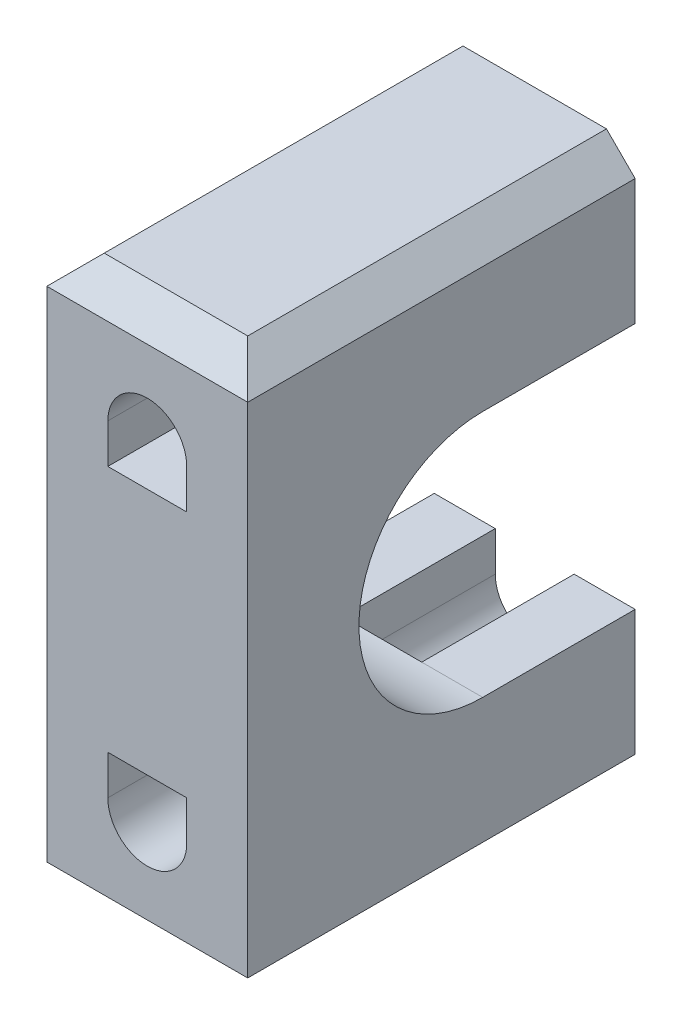
ISO-10303-21;
HEADER;
FILE_DESCRIPTION(('STEP AP214'),'2;1');
FILE_NAME('part.step','',(''),(''),'','','');
FILE_SCHEMA(('AUTOMOTIVE_DESIGN { 1 0 10303 214 1 1 1 1 }'));
ENDSEC;
DATA;
#1=APPLICATION_CONTEXT('core data for automotive mechanical design processes');
#2=APPLICATION_PROTOCOL_DEFINITION('international standard','automotive_design',2000,#1);
#3=PRODUCT_CONTEXT('',#1,'mechanical');
#4=PRODUCT('Part','Part','',(#3));
#5=PRODUCT_RELATED_PRODUCT_CATEGORY('part','',(#4));
#6=PRODUCT_DEFINITION_FORMATION('','',#4);
#7=PRODUCT_DEFINITION_CONTEXT('part definition',#1,'design');
#8=PRODUCT_DEFINITION('design','',#6,#7);
#9=PRODUCT_DEFINITION_SHAPE('','',#8);
#10=(LENGTH_UNIT() NAMED_UNIT(*) SI_UNIT(.MILLI.,.METRE.));
#11=(NAMED_UNIT(*) PLANE_ANGLE_UNIT() SI_UNIT($,.RADIAN.));
#12=(NAMED_UNIT(*) SI_UNIT($,.STERADIAN.) SOLID_ANGLE_UNIT());
#13=UNCERTAINTY_MEASURE_WITH_UNIT(LENGTH_MEASURE(1.E-05),#10,'distance_accuracy_value','');
#14=(GEOMETRIC_REPRESENTATION_CONTEXT(3) GLOBAL_UNCERTAINTY_ASSIGNED_CONTEXT((#13)) GLOBAL_UNIT_ASSIGNED_CONTEXT((#10,
#11,#12)) REPRESENTATION_CONTEXT('',''));
#15=CARTESIAN_POINT('',(0.,0.,0.));
#16=DIRECTION('',(0.,0.,1.));
#17=DIRECTION('',(1.,0.,0.));
#18=AXIS2_PLACEMENT_3D('',#15,#16,#17);
#19=CARTESIAN_POINT('',(0.,0.,0.));
#20=DIRECTION('',(0.,0.,1.));
#21=DIRECTION('',(1.,0.,0.));
#22=AXIS2_PLACEMENT_3D('',#19,#20,#21);
#23=PLANE('',#22);
#24=DIRECTION('',(1.,0.,0.));
#25=VECTOR('',#24,1.);
#26=CARTESIAN_POINT('',(0.,-19.375,0.));
#27=LINE('',#26,#25);
#28=CARTESIAN_POINT('',(-5.,-19.375,0.));
#29=VERTEX_POINT('',#28);
#30=CARTESIAN_POINT('',(4.99999999999999,-19.375,0.));
#31=VERTEX_POINT('',#30);
#32=EDGE_CURVE('E255',#29,#31,#27,.T.);
#33=ORIENTED_EDGE('',*,*,#32,.F.);
#34=DIRECTION('',(0.707106781186546,-0.707106781186549,0.));
#35=VECTOR('',#34,1.);
#36=CARTESIAN_POINT('',(-5.,-19.375,0.));
#37=LINE('',#36,#35);
#38=CARTESIAN_POINT('',(-7.,-17.375,0.));
#39=VERTEX_POINT('',#38);
#40=EDGE_CURVE('E340',#29,#39,#37,.F.);
#41=ORIENTED_EDGE('',*,*,#40,.T.);
#42=DIRECTION('',(0.,-1.,0.));
#43=VECTOR('',#42,1.);
#44=CARTESIAN_POINT('',(-7.,0.,0.));
#45=LINE('',#44,#43);
#46=CARTESIAN_POINT('',(-7.,-8.625,0.));
#47=VERTEX_POINT('',#46);
#48=EDGE_CURVE('E303',#47,#39,#45,.T.);
#49=ORIENTED_EDGE('',*,*,#48,.F.);
#50=DIRECTION('',(1.,0.,0.));
#51=VECTOR('',#50,1.);
#52=CARTESIAN_POINT('',(0.,-8.625,0.));
#53=LINE('',#52,#51);
#54=CARTESIAN_POINT('',(-2.75,-8.625,0.));
#55=VERTEX_POINT('',#54);
#56=EDGE_CURVE('E330',#47,#55,#53,.T.);
#57=ORIENTED_EDGE('',*,*,#56,.T.);
#58=DIRECTION('',(0.,1.,0.));
#59=VECTOR('',#58,1.);
#60=CARTESIAN_POINT('',(-2.75,0.,0.));
#61=LINE('',#60,#59);
#62=CARTESIAN_POINT('',(-2.75,-11.375,0.));
#63=VERTEX_POINT('',#62);
#64=EDGE_CURVE('E251',#63,#55,#61,.T.);
#65=ORIENTED_EDGE('',*,*,#64,.F.);
#66=CARTESIAN_POINT('',(0.,-11.375,0.));
#67=DIRECTION('',(0.,0.,1.));
#68=DIRECTION('',(1.,0.,0.));
#69=AXIS2_PLACEMENT_3D('',#66,#67,#68);
#70=CIRCLE('',#69,2.75);
#71=CARTESIAN_POINT('',(2.75,-11.375,0.));
#72=VERTEX_POINT('',#71);
#73=EDGE_CURVE('E286',#63,#72,#70,.T.);
#74=ORIENTED_EDGE('',*,*,#73,.T.);
#75=DIRECTION('',(0.,1.,0.));
#76=VECTOR('',#75,1.);
#77=CARTESIAN_POINT('',(2.75,0.,0.));
#78=LINE('',#77,#76);
#79=CARTESIAN_POINT('',(2.75,-8.625,0.));
#80=VERTEX_POINT('',#79);
#81=EDGE_CURVE('E283',#72,#80,#78,.T.);
#82=ORIENTED_EDGE('',*,*,#81,.T.);
#83=DIRECTION('',(-1.,0.,0.));
#84=VECTOR('',#83,1.);
#85=CARTESIAN_POINT('',(7.00000000000001,-8.625,0.));
#86=LINE('',#85,#84);
#87=CARTESIAN_POINT('',(7.00000000000001,-8.625,0.));
#88=VERTEX_POINT('',#87);
#89=EDGE_CURVE('E235',#88,#80,#86,.T.);
#90=ORIENTED_EDGE('',*,*,#89,.F.);
#91=DIRECTION('',(0.,-1.,0.));
#92=VECTOR('',#91,1.);
#93=CARTESIAN_POINT('',(7.,0.,0.));
#94=LINE('',#93,#92);
#95=CARTESIAN_POINT('',(7.00000000000001,-17.375,0.));
#96=VERTEX_POINT('',#95);
#97=EDGE_CURVE('E223',#88,#96,#94,.T.);
#98=ORIENTED_EDGE('',*,*,#97,.T.);
#99=DIRECTION('',(-0.707106781186549,-0.707106781186546,0.));
#100=VECTOR('',#99,1.);
#101=CARTESIAN_POINT('',(7.00000000000001,-17.375,0.));
#102=LINE('',#101,#100);
#103=EDGE_CURVE('E338',#96,#31,#102,.T.);
#104=ORIENTED_EDGE('',*,*,#103,.T.);
#105=EDGE_LOOP('',(#33,#41,#49,#57,#65,#74,#82,#90,#98,#104));
#106=FACE_BOUND('',#105,.T.);
#107=ADVANCED_FACE('F43',(#106),#23,.F.);
#108=CARTESIAN_POINT('',(7.,0.,27.));
#109=DIRECTION('',(1.,0.,0.));
#110=DIRECTION('',(0.,1.,0.));
#111=AXIS2_PLACEMENT_3D('',#108,#109,#110);
#112=PLANE('',#111);
#113=DIRECTION('',(0.,-1.,0.));
#114=VECTOR('',#113,1.);
#115=CARTESIAN_POINT('',(7.,0.,27.));
#116=LINE('',#115,#114);
#117=CARTESIAN_POINT('',(7.,17.375,27.));
#118=VERTEX_POINT('',#117);
#119=CARTESIAN_POINT('',(7.00000000000001,-17.375,27.));
#120=VERTEX_POINT('',#119);
#121=EDGE_CURVE('E275',#118,#120,#116,.T.);
#122=ORIENTED_EDGE('',*,*,#121,.T.);
#123=DIRECTION('',(0.,0.,-1.));
#124=VECTOR('',#123,1.);
#125=CARTESIAN_POINT('',(7.00000000000001,-17.375,0.));
#126=LINE('',#125,#124);
#127=EDGE_CURVE('E351',#120,#96,#126,.T.);
#128=ORIENTED_EDGE('',*,*,#127,.T.);
#129=ORIENTED_EDGE('',*,*,#97,.F.);
#130=DIRECTION('',(0.,0.,1.));
#131=VECTOR('',#130,1.);
#132=CARTESIAN_POINT('',(7.00000000000001,-8.625,0.));
#133=LINE('',#132,#131);
#134=CARTESIAN_POINT('',(7.00000000000001,-8.625,10.625));
#135=VERTEX_POINT('',#134);
#136=EDGE_CURVE('E196',#88,#135,#133,.T.);
#137=ORIENTED_EDGE('',*,*,#136,.T.);
#138=CARTESIAN_POINT('',(7.00000000000001,0.,10.625));
#139=DIRECTION('',(-1.,0.,0.));
#140=DIRECTION('',(0.,-1.,0.));
#141=AXIS2_PLACEMENT_3D('',#138,#139,#140);
#142=CIRCLE('',#141,8.625);
#143=CARTESIAN_POINT('',(7.00000000000001,8.625,10.625));
#144=VERTEX_POINT('',#143);
#145=EDGE_CURVE('E208',#135,#144,#142,.T.);
#146=ORIENTED_EDGE('',*,*,#145,.T.);
#147=DIRECTION('',(0.,0.,-1.));
#148=VECTOR('',#147,1.);
#149=CARTESIAN_POINT('',(7.00000000000001,8.625,0.));
#150=LINE('',#149,#148);
#151=CARTESIAN_POINT('',(7.00000000000001,8.625,0.));
#152=VERTEX_POINT('',#151);
#153=EDGE_CURVE('E216',#144,#152,#150,.T.);
#154=ORIENTED_EDGE('',*,*,#153,.T.);
#155=CARTESIAN_POINT('',(7.,17.375,0.));
#156=VERTEX_POINT('',#155);
#157=EDGE_CURVE('E298',#156,#152,#94,.T.);
#158=ORIENTED_EDGE('',*,*,#157,.F.);
#159=DIRECTION('',(0.,0.,1.));
#160=VECTOR('',#159,1.);
#161=CARTESIAN_POINT('',(7.,17.375,27.));
#162=LINE('',#161,#160);
#163=EDGE_CURVE('E348',#156,#118,#162,.T.);
#164=ORIENTED_EDGE('',*,*,#163,.T.);
#165=EDGE_LOOP('',(#122,#128,#129,#137,#146,#154,#158,#164));
#166=FACE_BOUND('',#165,.T.);
#167=ADVANCED_FACE('F220',(#166),#112,.T.);
#168=CARTESIAN_POINT('',(0.,19.375,27.));
#169=DIRECTION('',(0.,1.,0.));
#170=DIRECTION('',(0.,0.,1.));
#171=AXIS2_PLACEMENT_3D('',#168,#169,#170);
#172=PLANE('',#171);
#173=DIRECTION('',(0.,0.,1.));
#174=VECTOR('',#173,1.);
#175=CARTESIAN_POINT('',(-4.99999999999999,19.375,27.));
#176=LINE('',#175,#174);
#177=CARTESIAN_POINT('',(-4.99999999999999,19.375,0.));
#178=VERTEX_POINT('',#177);
#179=CARTESIAN_POINT('',(-4.99999999999999,19.375,25.));
#180=VERTEX_POINT('',#179);
#181=EDGE_CURVE('E359',#178,#180,#176,.T.);
#182=ORIENTED_EDGE('',*,*,#181,.T.);
#183=DIRECTION('',(1.,0.,0.));
#184=VECTOR('',#183,1.);
#185=CARTESIAN_POINT('',(0.,19.375,25.));
#186=LINE('',#185,#184);
#187=CARTESIAN_POINT('',(4.99999999999998,19.375,25.));
#188=VERTEX_POINT('',#187);
#189=EDGE_CURVE('E372',#180,#188,#186,.T.);
#190=ORIENTED_EDGE('',*,*,#189,.T.);
#191=DIRECTION('',(0.,0.,-1.));
#192=VECTOR('',#191,1.);
#193=CARTESIAN_POINT('',(4.99999999999998,19.375,27.));
#194=LINE('',#193,#192);
#195=CARTESIAN_POINT('',(4.99999999999998,19.375,0.));
#196=VERTEX_POINT('',#195);
#197=EDGE_CURVE('E357',#188,#196,#194,.T.);
#198=ORIENTED_EDGE('',*,*,#197,.T.);
#199=DIRECTION('',(1.,0.,0.));
#200=VECTOR('',#199,1.);
#201=CARTESIAN_POINT('',(0.,19.375,0.));
#202=LINE('',#201,#200);
#203=EDGE_CURVE('E300',#178,#196,#202,.T.);
#204=ORIENTED_EDGE('',*,*,#203,.F.);
#205=EDGE_LOOP('',(#182,#190,#198,#204));
#206=FACE_BOUND('',#205,.T.);
#207=ADVANCED_FACE('F386',(#206),#172,.T.);
#208=CARTESIAN_POINT('',(-7.,0.,27.));
#209=DIRECTION('',(1.,0.,0.));
#210=DIRECTION('',(0.,0.,-1.));
#211=AXIS2_PLACEMENT_3D('',#208,#209,#210);
#212=PLANE('',#211);
#213=ORIENTED_EDGE('',*,*,#48,.T.);
#214=DIRECTION('',(0.,0.,1.));
#215=VECTOR('',#214,1.);
#216=CARTESIAN_POINT('',(-7.,-17.375,27.));
#217=LINE('',#216,#215);
#218=CARTESIAN_POINT('',(-7.,-17.375,27.));
#219=VERTEX_POINT('',#218);
#220=EDGE_CURVE('E345',#39,#219,#217,.T.);
#221=ORIENTED_EDGE('',*,*,#220,.T.);
#222=DIRECTION('',(0.,-1.,0.));
#223=VECTOR('',#222,1.);
#224=CARTESIAN_POINT('',(-7.,0.,27.));
#225=LINE('',#224,#223);
#226=CARTESIAN_POINT('',(-7.,17.375,27.));
#227=VERTEX_POINT('',#226);
#228=EDGE_CURVE('E277',#227,#219,#225,.T.);
#229=ORIENTED_EDGE('',*,*,#228,.F.);
#230=DIRECTION('',(0.,0.,-1.));
#231=VECTOR('',#230,1.);
#232=CARTESIAN_POINT('',(-7.,17.375,0.));
#233=LINE('',#232,#231);
#234=CARTESIAN_POINT('',(-7.,17.375,0.));
#235=VERTEX_POINT('',#234);
#236=EDGE_CURVE('E342',#227,#235,#233,.T.);
#237=ORIENTED_EDGE('',*,*,#236,.T.);
#238=CARTESIAN_POINT('',(-7.,8.625,0.));
#239=VERTEX_POINT('',#238);
#240=EDGE_CURVE('E304',#235,#239,#45,.T.);
#241=ORIENTED_EDGE('',*,*,#240,.T.);
#242=DIRECTION('',(0.,0.,-1.));
#243=VECTOR('',#242,1.);
#244=CARTESIAN_POINT('',(-7.,8.625,0.));
#245=LINE('',#244,#243);
#246=CARTESIAN_POINT('',(-7.,8.625,10.625));
#247=VERTEX_POINT('',#246);
#248=EDGE_CURVE('E224',#247,#239,#245,.T.);
#249=ORIENTED_EDGE('',*,*,#248,.F.);
#250=CARTESIAN_POINT('',(-7.,0.,10.625));
#251=DIRECTION('',(-1.,0.,0.));
#252=DIRECTION('',(0.,-1.,0.));
#253=AXIS2_PLACEMENT_3D('',#250,#251,#252);
#254=CIRCLE('',#253,8.625);
#255=CARTESIAN_POINT('',(-7.,-8.625,10.625));
#256=VERTEX_POINT('',#255);
#257=EDGE_CURVE('E227',#256,#247,#254,.T.);
#258=ORIENTED_EDGE('',*,*,#257,.F.);
#259=DIRECTION('',(0.,0.,1.));
#260=VECTOR('',#259,1.);
#261=CARTESIAN_POINT('',(-7.,-8.625,0.));
#262=LINE('',#261,#260);
#263=EDGE_CURVE('E231',#47,#256,#262,.T.);
#264=ORIENTED_EDGE('',*,*,#263,.F.);
#265=EDGE_LOOP('',(#213,#221,#229,#237,#241,#249,#258,#264));
#266=FACE_BOUND('',#265,.T.);
#267=ADVANCED_FACE('F393',(#266),#212,.F.);
#268=CARTESIAN_POINT('',(0.,11.375,27.));
#269=DIRECTION('',(0.,0.,-1.));
#270=DIRECTION('',(-1.,0.,0.));
#271=AXIS2_PLACEMENT_3D('',#268,#269,#270);
#272=CYLINDRICAL_SURFACE('',#271,2.75);
#273=CARTESIAN_POINT('',(0.,11.375,0.));
#274=DIRECTION('',(0.,0.,1.));
#275=DIRECTION('',(1.,0.,0.));
#276=AXIS2_PLACEMENT_3D('',#273,#274,#275);
#277=CIRCLE('',#276,2.75);
#278=CARTESIAN_POINT('',(2.75,11.375,0.));
#279=VERTEX_POINT('',#278);
#280=CARTESIAN_POINT('',(-2.75,11.375,0.));
#281=VERTEX_POINT('',#280);
#282=EDGE_CURVE('E289',#279,#281,#277,.T.);
#283=ORIENTED_EDGE('',*,*,#282,.F.);
#284=DIRECTION('',(0.,0.,-1.));
#285=VECTOR('',#284,1.);
#286=CARTESIAN_POINT('',(2.75,11.375,27.));
#287=LINE('',#286,#285);
#288=CARTESIAN_POINT('',(2.75,11.375,27.));
#289=VERTEX_POINT('',#288);
#290=EDGE_CURVE('E317',#289,#279,#287,.T.);
#291=ORIENTED_EDGE('',*,*,#290,.F.);
#292=CARTESIAN_POINT('',(0.,11.375,27.));
#293=DIRECTION('',(0.,0.,1.));
#294=DIRECTION('',(1.,0.,0.));
#295=AXIS2_PLACEMENT_3D('',#292,#293,#294);
#296=CIRCLE('',#295,2.75);
#297=CARTESIAN_POINT('',(-2.75,11.375,27.));
#298=VERTEX_POINT('',#297);
#299=EDGE_CURVE('E264',#289,#298,#296,.T.);
#300=ORIENTED_EDGE('',*,*,#299,.T.);
#301=DIRECTION('',(0.,0.,-1.));
#302=VECTOR('',#301,1.);
#303=CARTESIAN_POINT('',(-2.75,11.375,27.));
#304=LINE('',#303,#302);
#305=EDGE_CURVE('E308',#298,#281,#304,.T.);
#306=ORIENTED_EDGE('',*,*,#305,.T.);
#307=EDGE_LOOP('',(#283,#291,#300,#306));
#308=FACE_BOUND('',#307,.T.);
#309=ADVANCED_FACE('F632',(#308),#272,.F.);
#310=CARTESIAN_POINT('',(2.75,0.,27.));
#311=DIRECTION('',(1.,0.,0.));
#312=DIRECTION('',(0.,0.,-1.));
#313=AXIS2_PLACEMENT_3D('',#310,#311,#312);
#314=PLANE('',#313);
#315=DIRECTION('',(0.,-1.,0.));
#316=VECTOR('',#315,1.);
#317=CARTESIAN_POINT('',(2.75,0.,0.));
#318=LINE('',#317,#316);
#319=CARTESIAN_POINT('',(2.75,8.625,0.));
#320=VERTEX_POINT('',#319);
#321=EDGE_CURVE('E292',#279,#320,#318,.T.);
#322=ORIENTED_EDGE('',*,*,#321,.T.);
#323=DIRECTION('',(0.,0.,1.));
#324=VECTOR('',#323,1.);
#325=CARTESIAN_POINT('',(2.75,8.62500000000001,27.));
#326=LINE('',#325,#324);
#327=CARTESIAN_POINT('',(2.75,8.625,10.625));
#328=VERTEX_POINT('',#327);
#329=EDGE_CURVE('E244',#320,#328,#326,.T.);
#330=ORIENTED_EDGE('',*,*,#329,.T.);
#331=DIRECTION('',(0.,0.,-1.));
#332=VECTOR('',#331,1.);
#333=CARTESIAN_POINT('',(2.75,8.625,27.));
#334=LINE('',#333,#332);
#335=CARTESIAN_POINT('',(2.75,8.625,27.));
#336=VERTEX_POINT('',#335);
#337=EDGE_CURVE('E314',#336,#328,#334,.T.);
#338=ORIENTED_EDGE('',*,*,#337,.F.);
#339=DIRECTION('',(0.,-1.,0.));
#340=VECTOR('',#339,1.);
#341=CARTESIAN_POINT('',(2.75,0.,27.));
#342=LINE('',#341,#340);
#343=EDGE_CURVE('E267',#289,#336,#342,.T.);
#344=ORIENTED_EDGE('',*,*,#343,.F.);
#345=ORIENTED_EDGE('',*,*,#290,.T.);
#346=EDGE_LOOP('',(#322,#330,#338,#344,#345));
#347=FACE_BOUND('',#346,.T.);
#348=ADVANCED_FACE('F624',(#347),#314,.F.);
#349=CARTESIAN_POINT('',(0.,8.625,27.));
#350=DIRECTION('',(0.,-1.,0.));
#351=DIRECTION('',(0.,0.,-1.));
#352=AXIS2_PLACEMENT_3D('',#349,#350,#351);
#353=PLANE('',#352);
#354=ORIENTED_EDGE('',*,*,#337,.T.);
#355=DIRECTION('',(-1.,0.,0.));
#356=VECTOR('',#355,1.);
#357=CARTESIAN_POINT('',(7.00000000000001,8.625,10.625));
#358=LINE('',#357,#356);
#359=CARTESIAN_POINT('',(-2.75,8.625,10.625));
#360=VERTEX_POINT('',#359);
#361=EDGE_CURVE('E241',#328,#360,#358,.T.);
#362=ORIENTED_EDGE('',*,*,#361,.T.);
#363=DIRECTION('',(0.,0.,-1.));
#364=VECTOR('',#363,1.);
#365=CARTESIAN_POINT('',(-2.75,8.625,27.));
#366=LINE('',#365,#364);
#367=CARTESIAN_POINT('',(-2.75,8.625,27.));
#368=VERTEX_POINT('',#367);
#369=EDGE_CURVE('E310',#368,#360,#366,.T.);
#370=ORIENTED_EDGE('',*,*,#369,.F.);
#371=DIRECTION('',(-1.,0.,0.));
#372=VECTOR('',#371,1.);
#373=CARTESIAN_POINT('',(0.,8.625,27.));
#374=LINE('',#373,#372);
#375=EDGE_CURVE('E270',#336,#368,#374,.T.);
#376=ORIENTED_EDGE('',*,*,#375,.F.);
#377=EDGE_LOOP('',(#354,#362,#370,#376));
#378=FACE_BOUND('',#377,.T.);
#379=ADVANCED_FACE('F407',(#378),#353,.F.);
#380=CARTESIAN_POINT('',(-2.75,0.,27.));
#381=DIRECTION('',(-1.,0.,0.));
#382=DIRECTION('',(0.,0.,1.));
#383=AXIS2_PLACEMENT_3D('',#380,#381,#382);
#384=PLANE('',#383);
#385=ORIENTED_EDGE('',*,*,#64,.T.);
#386=DIRECTION('',(0.,0.,1.));
#387=VECTOR('',#386,1.);
#388=CARTESIAN_POINT('',(-2.75,-8.62500000000001,27.));
#389=LINE('',#388,#387);
#390=CARTESIAN_POINT('',(-2.74999999999999,-8.625,10.625));
#391=VERTEX_POINT('',#390);
#392=EDGE_CURVE('E248',#55,#391,#389,.T.);
#393=ORIENTED_EDGE('',*,*,#392,.T.);
#394=DIRECTION('',(0.,0.,-1.));
#395=VECTOR('',#394,1.);
#396=CARTESIAN_POINT('',(-2.75,-8.625,27.));
#397=LINE('',#396,#395);
#398=CARTESIAN_POINT('',(-2.75,-8.625,27.));
#399=VERTEX_POINT('',#398);
#400=EDGE_CURVE('E311',#399,#391,#397,.T.);
#401=ORIENTED_EDGE('',*,*,#400,.F.);
#402=DIRECTION('',(0.,1.,0.));
#403=VECTOR('',#402,1.);
#404=CARTESIAN_POINT('',(-2.75,0.,27.));
#405=LINE('',#404,#403);
#406=CARTESIAN_POINT('',(-2.75,-11.375,27.));
#407=VERTEX_POINT('',#406);
#408=EDGE_CURVE('E252',#407,#399,#405,.T.);
#409=ORIENTED_EDGE('',*,*,#408,.F.);
#410=DIRECTION('',(0.,0.,-1.));
#411=VECTOR('',#410,1.);
#412=CARTESIAN_POINT('',(-2.75,-11.375,27.));
#413=LINE('',#412,#411);
#414=EDGE_CURVE('E280',#407,#63,#413,.T.);
#415=ORIENTED_EDGE('',*,*,#414,.T.);
#416=EDGE_LOOP('',(#385,#393,#401,#409,#415));
#417=FACE_BOUND('',#416,.T.);
#418=ADVANCED_FACE('F483',(#417),#384,.F.);
#419=CARTESIAN_POINT('',(0.,-8.625,27.));
#420=DIRECTION('',(0.,-1.,0.));
#421=DIRECTION('',(0.,0.,-1.));
#422=AXIS2_PLACEMENT_3D('',#419,#420,#421);
#423=PLANE('',#422);
#424=DIRECTION('',(-1.,0.,0.));
#425=VECTOR('',#424,1.);
#426=CARTESIAN_POINT('',(7.00000000000001,-8.625,10.625));
#427=LINE('',#426,#425);
#428=CARTESIAN_POINT('',(2.75,-8.625,10.625));
#429=VERTEX_POINT('',#428);
#430=EDGE_CURVE('E204',#429,#391,#427,.T.);
#431=ORIENTED_EDGE('',*,*,#430,.F.);
#432=DIRECTION('',(0.,0.,-1.));
#433=VECTOR('',#432,1.);
#434=CARTESIAN_POINT('',(2.75,-8.625,27.));
#435=LINE('',#434,#433);
#436=CARTESIAN_POINT('',(2.75,-8.625,27.));
#437=VERTEX_POINT('',#436);
#438=EDGE_CURVE('E323',#437,#429,#435,.T.);
#439=ORIENTED_EDGE('',*,*,#438,.F.);
#440=DIRECTION('',(-1.,0.,0.));
#441=VECTOR('',#440,1.);
#442=CARTESIAN_POINT('',(0.,-8.625,27.));
#443=LINE('',#442,#441);
#444=EDGE_CURVE('E254',#437,#399,#443,.T.);
#445=ORIENTED_EDGE('',*,*,#444,.T.);
#446=ORIENTED_EDGE('',*,*,#400,.T.);
#447=EDGE_LOOP('',(#431,#439,#445,#446));
#448=FACE_BOUND('',#447,.T.);
#449=ADVANCED_FACE('F598',(#448),#423,.T.);
#450=CARTESIAN_POINT('',(2.75,0.,27.));
#451=DIRECTION('',(-1.,0.,0.));
#452=DIRECTION('',(0.,0.,1.));
#453=AXIS2_PLACEMENT_3D('',#450,#451,#452);
#454=PLANE('',#453);
#455=ORIENTED_EDGE('',*,*,#81,.F.);
#456=DIRECTION('',(0.,0.,-1.));
#457=VECTOR('',#456,1.);
#458=CARTESIAN_POINT('',(2.75,-11.375,27.));
#459=LINE('',#458,#457);
#460=CARTESIAN_POINT('',(2.75,-11.375,27.));
#461=VERTEX_POINT('',#460);
#462=EDGE_CURVE('E321',#461,#72,#459,.T.);
#463=ORIENTED_EDGE('',*,*,#462,.F.);
#464=DIRECTION('',(0.,1.,0.));
#465=VECTOR('',#464,1.);
#466=CARTESIAN_POINT('',(2.75,0.,27.));
#467=LINE('',#466,#465);
#468=EDGE_CURVE('E258',#461,#437,#467,.T.);
#469=ORIENTED_EDGE('',*,*,#468,.T.);
#470=ORIENTED_EDGE('',*,*,#438,.T.);
#471=DIRECTION('',(0.,0.,1.));
#472=VECTOR('',#471,1.);
#473=CARTESIAN_POINT('',(2.75,-8.625,27.));
#474=LINE('',#473,#472);
#475=EDGE_CURVE('E199',#80,#429,#474,.T.);
#476=ORIENTED_EDGE('',*,*,#475,.F.);
#477=EDGE_LOOP('',(#455,#463,#469,#470,#476));
#478=FACE_BOUND('',#477,.T.);
#479=ADVANCED_FACE('F589',(#478),#454,.T.);
#480=CARTESIAN_POINT('',(-2.75,0.,27.));
#481=DIRECTION('',(1.,0.,0.));
#482=DIRECTION('',(0.,0.,-1.));
#483=AXIS2_PLACEMENT_3D('',#480,#481,#482);
#484=PLANE('',#483);
#485=DIRECTION('',(0.,-1.,0.));
#486=VECTOR('',#485,1.);
#487=CARTESIAN_POINT('',(-2.75,0.,0.));
#488=LINE('',#487,#486);
#489=CARTESIAN_POINT('',(-2.75,8.625,0.));
#490=VERTEX_POINT('',#489);
#491=EDGE_CURVE('E295',#281,#490,#488,.T.);
#492=ORIENTED_EDGE('',*,*,#491,.F.);
#493=ORIENTED_EDGE('',*,*,#305,.F.);
#494=DIRECTION('',(0.,-1.,0.));
#495=VECTOR('',#494,1.);
#496=CARTESIAN_POINT('',(-2.75,0.,27.));
#497=LINE('',#496,#495);
#498=EDGE_CURVE('E272',#298,#368,#497,.T.);
#499=ORIENTED_EDGE('',*,*,#498,.T.);
#500=ORIENTED_EDGE('',*,*,#369,.T.);
#501=DIRECTION('',(0.,0.,1.));
#502=VECTOR('',#501,1.);
#503=CARTESIAN_POINT('',(-2.75,8.62500000000001,27.));
#504=LINE('',#503,#502);
#505=EDGE_CURVE('E237',#490,#360,#504,.T.);
#506=ORIENTED_EDGE('',*,*,#505,.F.);
#507=EDGE_LOOP('',(#492,#493,#499,#500,#506));
#508=FACE_BOUND('',#507,.T.);
#509=ADVANCED_FACE('F402',(#508),#484,.T.);
#510=CARTESIAN_POINT('',(0.,-11.375,27.));
#511=DIRECTION('',(0.,0.,-1.));
#512=DIRECTION('',(-1.,0.,0.));
#513=AXIS2_PLACEMENT_3D('',#510,#511,#512);
#514=CYLINDRICAL_SURFACE('',#513,2.75);
#515=ORIENTED_EDGE('',*,*,#73,.F.);
#516=ORIENTED_EDGE('',*,*,#414,.F.);
#517=CARTESIAN_POINT('',(0.,-11.375,27.));
#518=DIRECTION('',(0.,0.,1.));
#519=DIRECTION('',(1.,0.,0.));
#520=AXIS2_PLACEMENT_3D('',#517,#518,#519);
#521=CIRCLE('',#520,2.75);
#522=EDGE_CURVE('E261',#407,#461,#521,.T.);
#523=ORIENTED_EDGE('',*,*,#522,.T.);
#524=ORIENTED_EDGE('',*,*,#462,.T.);
#525=EDGE_LOOP('',(#515,#516,#523,#524));
#526=FACE_BOUND('',#525,.T.);
#527=ADVANCED_FACE('F431',(#526),#514,.F.);
#528=CARTESIAN_POINT('',(0.,-19.375,27.));
#529=DIRECTION('',(0.,1.,0.));
#530=DIRECTION('',(0.,0.,1.));
#531=AXIS2_PLACEMENT_3D('',#528,#529,#530);
#532=PLANE('',#531);
#533=DIRECTION('',(0.,0.,1.));
#534=VECTOR('',#533,1.);
#535=CARTESIAN_POINT('',(4.99999999999999,-19.375,27.));
#536=LINE('',#535,#534);
#537=CARTESIAN_POINT('',(4.99999999999999,-19.375,25.));
#538=VERTEX_POINT('',#537);
#539=EDGE_CURVE('E333',#31,#538,#536,.T.);
#540=ORIENTED_EDGE('',*,*,#539,.T.);
#541=DIRECTION('',(-1.,0.,0.));
#542=VECTOR('',#541,1.);
#543=CARTESIAN_POINT('',(-5.,-19.375,25.));
#544=LINE('',#543,#542);
#545=CARTESIAN_POINT('',(-5.,-19.375,25.));
#546=VERTEX_POINT('',#545);
#547=EDGE_CURVE('E368',#538,#546,#544,.T.);
#548=ORIENTED_EDGE('',*,*,#547,.T.);
#549=DIRECTION('',(0.,0.,-1.));
#550=VECTOR('',#549,1.);
#551=CARTESIAN_POINT('',(-5.,-19.375,27.));
#552=LINE('',#551,#550);
#553=EDGE_CURVE('E336',#546,#29,#552,.T.);
#554=ORIENTED_EDGE('',*,*,#553,.T.);
#555=ORIENTED_EDGE('',*,*,#32,.T.);
#556=EDGE_LOOP('',(#540,#548,#554,#555));
#557=FACE_BOUND('',#556,.T.);
#558=ADVANCED_FACE('F429',(#557),#532,.F.);
#559=CARTESIAN_POINT('',(0.,0.,27.));
#560=DIRECTION('',(0.,0.,1.));
#561=DIRECTION('',(1.,0.,0.));
#562=AXIS2_PLACEMENT_3D('',#559,#560,#561);
#563=PLANE('',#562);
#564=ORIENTED_EDGE('',*,*,#408,.T.);
#565=ORIENTED_EDGE('',*,*,#444,.F.);
#566=ORIENTED_EDGE('',*,*,#468,.F.);
#567=ORIENTED_EDGE('',*,*,#522,.F.);
#568=EDGE_LOOP('',(#564,#565,#566,#567));
#569=FACE_BOUND('',#568,.T.);
#570=ORIENTED_EDGE('',*,*,#299,.F.);
#571=ORIENTED_EDGE('',*,*,#343,.T.);
#572=ORIENTED_EDGE('',*,*,#375,.T.);
#573=ORIENTED_EDGE('',*,*,#498,.F.);
#574=EDGE_LOOP('',(#570,#571,#572,#573));
#575=FACE_BOUND('',#574,.T.);
#576=ORIENTED_EDGE('',*,*,#228,.T.);
#577=DIRECTION('',(1.,0.,0.));
#578=VECTOR('',#577,1.);
#579=CARTESIAN_POINT('',(4.99999999999999,-17.375,27.));
#580=LINE('',#579,#578);
#581=EDGE_CURVE('E363',#219,#120,#580,.T.);
#582=ORIENTED_EDGE('',*,*,#581,.T.);
#583=ORIENTED_EDGE('',*,*,#121,.F.);
#584=DIRECTION('',(-1.,0.,0.));
#585=VECTOR('',#584,1.);
#586=CARTESIAN_POINT('',(0.,17.375,27.));
#587=LINE('',#586,#585);
#588=EDGE_CURVE('E361',#118,#227,#587,.T.);
#589=ORIENTED_EDGE('',*,*,#588,.T.);
#590=EDGE_LOOP('',(#576,#582,#583,#589));
#591=FACE_BOUND('',#590,.T.);
#592=ADVANCED_FACE('F382',(#569,#575,#591),#563,.T.);
#593=ORIENTED_EDGE('',*,*,#240,.F.);
#594=DIRECTION('',(0.707106781186549,0.707106781186546,0.));
#595=VECTOR('',#594,1.);
#596=CARTESIAN_POINT('',(-7.,17.375,0.));
#597=LINE('',#596,#595);
#598=EDGE_CURVE('E355',#235,#178,#597,.T.);
#599=ORIENTED_EDGE('',*,*,#598,.T.);
#600=ORIENTED_EDGE('',*,*,#203,.T.);
#601=DIRECTION('',(-0.707106781186548,0.707106781186548,0.));
#602=VECTOR('',#601,1.);
#603=CARTESIAN_POINT('',(4.99999999999998,19.375,0.));
#604=LINE('',#603,#602);
#605=EDGE_CURVE('E353',#196,#156,#604,.F.);
#606=ORIENTED_EDGE('',*,*,#605,.T.);
#607=ORIENTED_EDGE('',*,*,#157,.T.);
#608=DIRECTION('',(-1.,0.,0.));
#609=VECTOR('',#608,1.);
#610=CARTESIAN_POINT('',(7.00000000000001,8.625,0.));
#611=LINE('',#610,#609);
#612=EDGE_CURVE('E238',#152,#320,#611,.T.);
#613=ORIENTED_EDGE('',*,*,#612,.T.);
#614=ORIENTED_EDGE('',*,*,#321,.F.);
#615=ORIENTED_EDGE('',*,*,#282,.T.);
#616=ORIENTED_EDGE('',*,*,#491,.T.);
#617=DIRECTION('',(-1.,0.,0.));
#618=VECTOR('',#617,1.);
#619=CARTESIAN_POINT('',(0.,8.625,0.));
#620=LINE('',#619,#618);
#621=EDGE_CURVE('E319',#490,#239,#620,.T.);
#622=ORIENTED_EDGE('',*,*,#621,.T.);
#623=EDGE_LOOP('',(#593,#599,#600,#606,#607,#613,#614,#615,#616,#622));
#624=FACE_BOUND('',#623,.T.);
#625=ADVANCED_FACE('F395',(#624),#23,.F.);
#626=CARTESIAN_POINT('',(7.00000000000001,-8.625,0.));
#627=DIRECTION('',(0.,-1.,0.));
#628=DIRECTION('',(0.,0.,-1.));
#629=AXIS2_PLACEMENT_3D('',#626,#627,#628);
#630=PLANE('',#629);
#631=ORIENTED_EDGE('',*,*,#56,.F.);
#632=ORIENTED_EDGE('',*,*,#263,.T.);
#633=EDGE_CURVE('E206',#391,#256,#427,.T.);
#634=ORIENTED_EDGE('',*,*,#633,.F.);
#635=ORIENTED_EDGE('',*,*,#392,.F.);
#636=EDGE_LOOP('',(#631,#632,#634,#635));
#637=FACE_BOUND('',#636,.T.);
#638=ADVANCED_FACE('F451',(#637),#630,.F.);
#639=CARTESIAN_POINT('',(7.00000000000001,8.625,0.));
#640=DIRECTION('',(0.,1.,0.));
#641=DIRECTION('',(0.,0.,1.));
#642=AXIS2_PLACEMENT_3D('',#639,#640,#641);
#643=PLANE('',#642);
#644=ORIENTED_EDGE('',*,*,#612,.F.);
#645=ORIENTED_EDGE('',*,*,#153,.F.);
#646=EDGE_CURVE('E212',#144,#328,#358,.T.);
#647=ORIENTED_EDGE('',*,*,#646,.T.);
#648=ORIENTED_EDGE('',*,*,#329,.F.);
#649=EDGE_LOOP('',(#644,#645,#647,#648));
#650=FACE_BOUND('',#649,.T.);
#651=ADVANCED_FACE('F455',(#650),#643,.F.);
#652=ORIENTED_EDGE('',*,*,#475,.T.);
#653=EDGE_CURVE('E192',#135,#429,#427,.T.);
#654=ORIENTED_EDGE('',*,*,#653,.F.);
#655=ORIENTED_EDGE('',*,*,#136,.F.);
#656=ORIENTED_EDGE('',*,*,#89,.T.);
#657=EDGE_LOOP('',(#652,#654,#655,#656));
#658=FACE_BOUND('',#657,.T.);
#659=ADVANCED_FACE('F194',(#658),#630,.F.);
#660=ORIENTED_EDGE('',*,*,#505,.T.);
#661=EDGE_CURVE('E203',#360,#247,#358,.T.);
#662=ORIENTED_EDGE('',*,*,#661,.T.);
#663=ORIENTED_EDGE('',*,*,#248,.T.);
#664=ORIENTED_EDGE('',*,*,#621,.F.);
#665=EDGE_LOOP('',(#660,#662,#663,#664));
#666=FACE_BOUND('',#665,.T.);
#667=ADVANCED_FACE('F399',(#666),#643,.F.);
#668=CARTESIAN_POINT('',(7.00000000000001,0.,10.625));
#669=DIRECTION('',(-1.,0.,0.));
#670=DIRECTION('',(0.,-1.,0.));
#671=AXIS2_PLACEMENT_3D('',#668,#669,#670);
#672=CYLINDRICAL_SURFACE('',#671,8.625);
#673=ORIENTED_EDGE('',*,*,#257,.T.);
#674=ORIENTED_EDGE('',*,*,#661,.F.);
#675=ORIENTED_EDGE('',*,*,#361,.F.);
#676=ORIENTED_EDGE('',*,*,#646,.F.);
#677=ORIENTED_EDGE('',*,*,#145,.F.);
#678=ORIENTED_EDGE('',*,*,#653,.T.);
#679=ORIENTED_EDGE('',*,*,#430,.T.);
#680=ORIENTED_EDGE('',*,*,#633,.T.);
#681=EDGE_LOOP('',(#673,#674,#675,#676,#677,#678,#679,#680));
#682=FACE_BOUND('',#681,.T.);
#683=ADVANCED_FACE('F210',(#682),#672,.F.);
#684=CARTESIAN_POINT('',(-5.,-19.375,27.));
#685=DIRECTION('',(0.707106781186549,0.707106781186546,0.));
#686=DIRECTION('',(0.,0.,-1.));
#687=AXIS2_PLACEMENT_3D('',#684,#685,#686);
#688=PLANE('',#687);
#689=ORIENTED_EDGE('',*,*,#553,.F.);
#690=DIRECTION('',(0.577350269189624,-0.577350269189626,-0.577350269189628));
#691=VECTOR('',#690,1.);
#692=CARTESIAN_POINT('',(-5.66666666666667,-18.7083333333333,25.6666666666667));
#693=LINE('',#692,#691);
#694=EDGE_CURVE('E370',#546,#219,#693,.F.);
#695=ORIENTED_EDGE('',*,*,#694,.T.);
#696=ORIENTED_EDGE('',*,*,#220,.F.);
#697=ORIENTED_EDGE('',*,*,#40,.F.);
#698=EDGE_LOOP('',(#689,#695,#696,#697));
#699=FACE_BOUND('',#698,.T.);
#700=ADVANCED_FACE('F420',(#699),#688,.F.);
#701=CARTESIAN_POINT('',(7.00000000000001,-17.375,27.));
#702=DIRECTION('',(0.707106781186546,-0.707106781186549,0.));
#703=DIRECTION('',(0.,0.,1.));
#704=AXIS2_PLACEMENT_3D('',#701,#702,#703);
#705=PLANE('',#704);
#706=ORIENTED_EDGE('',*,*,#127,.F.);
#707=DIRECTION('',(-0.577350269189626,-0.577350269189624,-0.577350269189626));
#708=VECTOR('',#707,1.);
#709=CARTESIAN_POINT('',(7.,-17.375,27.));
#710=LINE('',#709,#708);
#711=EDGE_CURVE('E366',#120,#538,#710,.T.);
#712=ORIENTED_EDGE('',*,*,#711,.T.);
#713=ORIENTED_EDGE('',*,*,#539,.F.);
#714=ORIENTED_EDGE('',*,*,#103,.F.);
#715=EDGE_LOOP('',(#706,#712,#713,#714));
#716=FACE_BOUND('',#715,.T.);
#717=ADVANCED_FACE('F427',(#716),#705,.T.);
#718=CARTESIAN_POINT('',(-7.,17.375,27.));
#719=DIRECTION('',(-0.707106781186546,0.707106781186549,0.));
#720=DIRECTION('',(0.,0.,1.));
#721=AXIS2_PLACEMENT_3D('',#718,#719,#720);
#722=PLANE('',#721);
#723=ORIENTED_EDGE('',*,*,#236,.F.);
#724=DIRECTION('',(-0.577350269189628,-0.577350269189626,0.577350269189624));
#725=VECTOR('',#724,1.);
#726=CARTESIAN_POINT('',(-7.,17.375,27.));
#727=LINE('',#726,#725);
#728=EDGE_CURVE('E11',#227,#180,#727,.F.);
#729=ORIENTED_EDGE('',*,*,#728,.T.);
#730=ORIENTED_EDGE('',*,*,#181,.F.);
#731=ORIENTED_EDGE('',*,*,#598,.F.);
#732=EDGE_LOOP('',(#723,#729,#730,#731));
#733=FACE_BOUND('',#732,.T.);
#734=ADVANCED_FACE('F388',(#733),#722,.T.);
#735=CARTESIAN_POINT('',(4.99999999999998,19.375,27.));
#736=DIRECTION('',(-0.707106781186547,-0.707106781186547,0.));
#737=DIRECTION('',(0.,0.,-1.));
#738=AXIS2_PLACEMENT_3D('',#735,#736,#737);
#739=PLANE('',#738);
#740=ORIENTED_EDGE('',*,*,#197,.F.);
#741=DIRECTION('',(0.577350269189626,-0.577350269189626,0.577350269189624));
#742=VECTOR('',#741,1.);
#743=CARTESIAN_POINT('',(5.66666666666665,18.7083333333333,25.6666666666667));
#744=LINE('',#743,#742);
#745=EDGE_CURVE('E52',#188,#118,#744,.T.);
#746=ORIENTED_EDGE('',*,*,#745,.T.);
#747=ORIENTED_EDGE('',*,*,#163,.F.);
#748=ORIENTED_EDGE('',*,*,#605,.F.);
#749=EDGE_LOOP('',(#740,#746,#747,#748));
#750=FACE_BOUND('',#749,.T.);
#751=ADVANCED_FACE('F376',(#750),#739,.F.);
#752=CARTESIAN_POINT('',(0.,-17.375,27.));
#753=DIRECTION('',(0.,-0.707106781186549,0.707106781186546));
#754=DIRECTION('',(-1.,0.,0.));
#755=AXIS2_PLACEMENT_3D('',#752,#753,#754);
#756=PLANE('',#755);
#757=ORIENTED_EDGE('',*,*,#694,.F.);
#758=ORIENTED_EDGE('',*,*,#547,.F.);
#759=ORIENTED_EDGE('',*,*,#711,.F.);
#760=ORIENTED_EDGE('',*,*,#581,.F.);
#761=EDGE_LOOP('',(#757,#758,#759,#760));
#762=FACE_BOUND('',#761,.T.);
#763=ADVANCED_FACE('F423',(#762),#756,.T.);
#764=CARTESIAN_POINT('',(0.,19.375,25.));
#765=DIRECTION('',(0.,-0.707106781186546,-0.707106781186549));
#766=DIRECTION('',(1.,0.,0.));
#767=AXIS2_PLACEMENT_3D('',#764,#765,#766);
#768=PLANE('',#767);
#769=ORIENTED_EDGE('',*,*,#728,.F.);
#770=ORIENTED_EDGE('',*,*,#588,.F.);
#771=ORIENTED_EDGE('',*,*,#745,.F.);
#772=ORIENTED_EDGE('',*,*,#189,.F.);
#773=EDGE_LOOP('',(#769,#770,#771,#772));
#774=FACE_BOUND('',#773,.T.);
#775=ADVANCED_FACE('F46',(#774),#768,.F.);
#776=CLOSED_SHELL('',(#107,#167,#207,#267,#309,#348,#379,#418,#449,#479,#509,#527,#558,#592,
#625,#638,#651,#659,#667,#683,#700,#717,#734,#751,#763,#775));
#777=MANIFOLD_SOLID_BREP('B2',#776);
#778=ADVANCED_BREP_SHAPE_REPRESENTATION('',(#18,#777),#14);
#779=SHAPE_DEFINITION_REPRESENTATION(#9,#778);
ENDSEC;
END-ISO-10303-21;
